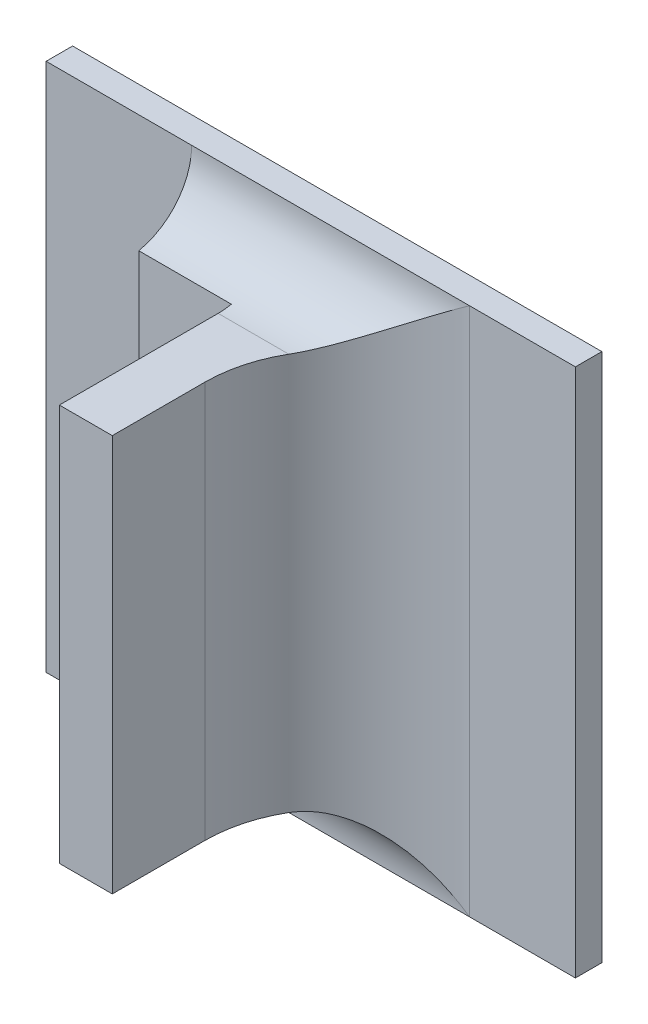
ISO-10303-21;
HEADER;
FILE_DESCRIPTION(('STEP AP214'),'2;1');
FILE_NAME('part.step','',(''),(''),'','','');
FILE_SCHEMA(('AUTOMOTIVE_DESIGN { 1 0 10303 214 1 1 1 1 }'));
ENDSEC;
DATA;
#1=APPLICATION_CONTEXT('core data for automotive mechanical design processes');
#2=APPLICATION_PROTOCOL_DEFINITION('international standard','automotive_design',2000,#1);
#3=PRODUCT_CONTEXT('',#1,'mechanical');
#4=PRODUCT('Part','Part','',(#3));
#5=PRODUCT_RELATED_PRODUCT_CATEGORY('part','',(#4));
#6=PRODUCT_DEFINITION_FORMATION('','',#4);
#7=PRODUCT_DEFINITION_CONTEXT('part definition',#1,'design');
#8=PRODUCT_DEFINITION('design','',#6,#7);
#9=PRODUCT_DEFINITION_SHAPE('','',#8);
#10=(LENGTH_UNIT() NAMED_UNIT(*) SI_UNIT(.MILLI.,.METRE.));
#11=(NAMED_UNIT(*) PLANE_ANGLE_UNIT() SI_UNIT($,.RADIAN.));
#12=(NAMED_UNIT(*) SI_UNIT($,.STERADIAN.) SOLID_ANGLE_UNIT());
#13=UNCERTAINTY_MEASURE_WITH_UNIT(LENGTH_MEASURE(1.E-05),#10,'distance_accuracy_value','');
#14=(GEOMETRIC_REPRESENTATION_CONTEXT(3) GLOBAL_UNCERTAINTY_ASSIGNED_CONTEXT((#13)) GLOBAL_UNIT_ASSIGNED_CONTEXT((#10,
#11,#12)) REPRESENTATION_CONTEXT('',''));
#15=CARTESIAN_POINT('',(0.,0.,0.));
#16=DIRECTION('',(0.,0.,1.));
#17=DIRECTION('',(1.,0.,0.));
#18=AXIS2_PLACEMENT_3D('',#15,#16,#17);
#19=CARTESIAN_POINT('',(-0.249341450663713,-0.311549667580546,0.0796271653543306));
#20=DIRECTION('',(-1.,0.,0.));
#21=DIRECTION('',(0.,-1.,0.));
#22=AXIS2_PLACEMENT_3D('',#19,#20,#21);
#23=PLANE('',#22);
#24=DIRECTION('',(0.,-1.,0.));
#25=VECTOR('',#24,1.);
#26=CARTESIAN_POINT('',(-0.249341450663713,-0.36005360458842,0.0800681102362204));
#27=LINE('',#26,#25);
#28=CARTESIAN_POINT('',(-0.249341450663713,-0.351234706950624,0.0800681102362204));
#29=VERTEX_POINT('',#28);
#30=CARTESIAN_POINT('',(-0.249341450663713,-0.313439431360073,0.0800681102362204));
#31=VERTEX_POINT('',#30);
#32=EDGE_CURVE('E116',#29,#31,#27,.F.);
#33=ORIENTED_EDGE('',*,*,#32,.T.);
#34=DIRECTION('',(0.,0.,1.));
#35=VECTOR('',#34,1.);
#36=CARTESIAN_POINT('',(-0.249341450663713,-0.313439431360073,0.0730129921259841));
#37=LINE('',#36,#35);
#38=CARTESIAN_POINT('',(-0.249341450663713,-0.313439431360073,0.0888870078740156));
#39=VERTEX_POINT('',#38);
#40=EDGE_CURVE('E294',#39,#31,#37,.F.);
#41=ORIENTED_EDGE('',*,*,#40,.F.);
#42=DIRECTION('',(0.,1.,0.));
#43=VECTOR('',#42,1.);
#44=CARTESIAN_POINT('',(-0.249341450663713,-0.311549667580546,0.0888870078740156));
#45=LINE('',#44,#43);
#46=CARTESIAN_POINT('',(-0.249341450663713,-0.351234706950624,0.0888870078740156));
#47=VERTEX_POINT('',#46);
#48=EDGE_CURVE('E306',#39,#47,#45,.F.);
#49=ORIENTED_EDGE('',*,*,#48,.T.);
#50=DIRECTION('',(0.,0.,1.));
#51=VECTOR('',#50,1.);
#52=CARTESIAN_POINT('',(-0.249341450663713,-0.351234706950624,0.0730129921259841));
#53=LINE('',#52,#51);
#54=EDGE_CURVE('E305',#47,#29,#53,.F.);
#55=ORIENTED_EDGE('',*,*,#54,.T.);
#56=EDGE_LOOP('',(#33,#41,#49,#55));
#57=FACE_BOUND('',#56,.T.);
#58=ADVANCED_FACE('F17',(#57),#23,.F.);
#59=CARTESIAN_POINT('',(-0.25463278924639,-0.311549667580546,0.0888870078740156));
#60=DIRECTION('',(0.,0.,-1.));
#61=DIRECTION('',(-1.,0.,0.));
#62=AXIS2_PLACEMENT_3D('',#59,#60,#61);
#63=PLANE('',#62);
#64=DIRECTION('',(0.,1.,0.));
#65=VECTOR('',#64,1.);
#66=CARTESIAN_POINT('',(-0.254380820742453,-0.35326446766354,0.0888870078740156));
#67=LINE('',#66,#65);
#68=CARTESIAN_POINT('',(-0.254380820742453,-0.313439431360073,0.0888870078740156));
#69=VERTEX_POINT('',#68);
#70=CARTESIAN_POINT('',(-0.254380820742453,-0.351234706950624,0.0888870078740156));
#71=VERTEX_POINT('',#70);
#72=EDGE_CURVE('E297',#69,#71,#67,.F.);
#73=ORIENTED_EDGE('',*,*,#72,.T.);
#74=DIRECTION('',(-1.,0.,0.));
#75=VECTOR('',#74,1.);
#76=CARTESIAN_POINT('',(-0.247317219784641,-0.351234706950624,0.0888870078740156));
#77=LINE('',#76,#75);
#78=EDGE_CURVE('E302',#71,#47,#77,.F.);
#79=ORIENTED_EDGE('',*,*,#78,.T.);
#80=ORIENTED_EDGE('',*,*,#48,.F.);
#81=DIRECTION('',(-1.,0.,0.));
#82=VECTOR('',#81,1.);
#83=CARTESIAN_POINT('',(-0.247317219784641,-0.313439431360073,0.0888870078740156));
#84=LINE('',#83,#82);
#85=EDGE_CURVE('E291',#69,#39,#84,.F.);
#86=ORIENTED_EDGE('',*,*,#85,.F.);
#87=EDGE_LOOP('',(#73,#79,#80,#86));
#88=FACE_BOUND('',#87,.T.);
#89=ADVANCED_FACE('F321',(#88),#63,.F.);
#90=CARTESIAN_POINT('',(-0.247317219784641,-0.351234706950624,0.0730129921259841));
#91=DIRECTION('',(0.,1.,0.));
#92=DIRECTION('',(-1.,0.,0.));
#93=AXIS2_PLACEMENT_3D('',#90,#91,#92);
#94=PLANE('',#93);
#95=DIRECTION('',(-1.,0.,0.));
#96=VECTOR('',#95,1.);
#97=CARTESIAN_POINT('',(-0.289656411293635,-0.351234706950625,0.0737688976377952));
#98=LINE('',#97,#96);
#99=CARTESIAN_POINT('',(-0.254380820742453,-0.351234706950624,0.0737688976377952));
#100=VERTEX_POINT('',#99);
#101=CARTESIAN_POINT('',(-0.247653581735013,-0.351234706950624,0.0737688976377951));
#102=VERTEX_POINT('',#101);
#103=EDGE_CURVE('E127',#100,#102,#98,.F.);
#104=ORIENTED_EDGE('',*,*,#103,.T.);
#105=CARTESIAN_POINT('',(-0.236743025466863,-0.351234706950624,0.0800681102362204));
#106=DIRECTION('',(0.,-1.,0.));
#107=DIRECTION('',(1.,0.,0.));
#108=AXIS2_PLACEMENT_3D('',#105,#106,#107);
#109=CIRCLE('',#108,0.0125984251968504);
#110=EDGE_CURVE('E20',#102,#29,#109,.F.);
#111=ORIENTED_EDGE('',*,*,#110,.T.);
#112=ORIENTED_EDGE('',*,*,#54,.F.);
#113=ORIENTED_EDGE('',*,*,#78,.F.);
#114=DIRECTION('',(0.,0.,1.));
#115=VECTOR('',#114,1.);
#116=CARTESIAN_POINT('',(-0.254380820742453,-0.351234706950624,0.0716901574803148));
#117=LINE('',#116,#115);
#118=EDGE_CURVE('E135',#71,#100,#117,.F.);
#119=ORIENTED_EDGE('',*,*,#118,.T.);
#120=EDGE_LOOP('',(#104,#111,#112,#113,#119));
#121=FACE_BOUND('',#120,.T.);
#122=ADVANCED_FACE('F133',(#121),#94,.F.);
#123=CARTESIAN_POINT('',(-0.263640663262139,-0.311409670647157,0.0725090551181101));
#124=DIRECTION('',(0.,0.,-1.));
#125=DIRECTION('',(-1.,0.,0.));
#126=AXIS2_PLACEMENT_3D('',#123,#124,#125);
#127=PLANE('',#126);
#128=DIRECTION('',(1.,0.,0.));
#129=VECTOR('',#128,1.);
#130=CARTESIAN_POINT('',(-0.235420190821194,-0.313312161420629,0.0725090551181101));
#131=LINE('',#130,#129);
#132=CARTESIAN_POINT('',(-0.254380820742453,-0.313312161420629,0.0725090551181101));
#133=VERTEX_POINT('',#132);
#134=CARTESIAN_POINT('',(-0.263199718380249,-0.313312161420629,0.0725090551181101));
#135=VERTEX_POINT('',#134);
#136=EDGE_CURVE('E142',#133,#135,#131,.F.);
#137=ORIENTED_EDGE('',*,*,#136,.T.);
#138=DIRECTION('',(0.,1.,0.));
#139=VECTOR('',#138,1.);
#140=CARTESIAN_POINT('',(-0.263199718380249,-0.304620533722278,0.0725090551181101));
#141=LINE('',#140,#139);
#142=CARTESIAN_POINT('',(-0.263199718380249,-0.351361976890069,0.0725090551181102));
#143=VERTEX_POINT('',#142);
#144=EDGE_CURVE('E146',#135,#143,#141,.F.);
#145=ORIENTED_EDGE('',*,*,#144,.T.);
#146=DIRECTION('',(-1.,0.,0.));
#147=VECTOR('',#146,1.);
#148=CARTESIAN_POINT('',(-0.289656411293635,-0.351361976890069,0.0725090551181103));
#149=LINE('',#148,#147);
#150=CARTESIAN_POINT('',(-0.254380820742453,-0.351361976890068,0.0725090551181101));
#151=VERTEX_POINT('',#150);
#152=EDGE_CURVE('E138',#143,#151,#149,.F.);
#153=ORIENTED_EDGE('',*,*,#152,.T.);
#154=DIRECTION('',(0.,1.,0.));
#155=VECTOR('',#154,1.);
#156=CARTESIAN_POINT('',(-0.254380820742453,-0.35326446766354,0.0725090551181101));
#157=LINE('',#156,#155);
#158=EDGE_CURVE('E324',#151,#133,#157,.T.);
#159=ORIENTED_EDGE('',*,*,#158,.T.);
#160=EDGE_LOOP('',(#137,#145,#153,#159));
#161=FACE_BOUND('',#160,.T.);
#162=ADVANCED_FACE('F193',(#161),#127,.F.);
#163=CARTESIAN_POINT('',(-0.236743025466863,-0.36005360458842,0.0800681102362204));
#164=DIRECTION('',(0.,-1.,0.));
#165=DIRECTION('',(1.,0.,0.));
#166=AXIS2_PLACEMENT_3D('',#163,#164,#165);
#167=CYLINDRICAL_SURFACE('',#166,0.0125984251968504);
#168=CARTESIAN_POINT('',(-0.247653581735013,-0.351234706950625,0.073768897637795));
#169=CARTESIAN_POINT('',(-0.247381097230534,-0.351235264602845,0.0732955457546591));
#170=CARTESIAN_POINT('',(-0.24707898510493,-0.351287791933284,0.0728445682080298));
#171=CARTESIAN_POINT('',(-0.246433517330929,-0.351472774611582,0.0720003898002664));
#172=CARTESIAN_POINT('',(-0.246090784855673,-0.351604122731852,0.0716064807283955));
#173=CARTESIAN_POINT('',(-0.245305547730899,-0.351954482138245,0.0708064921171964));
#174=CARTESIAN_POINT('',(-0.244856476602596,-0.35218542937407,0.0704123993317733));
#175=CARTESIAN_POINT('',(-0.243926550340997,-0.352703528005896,0.0697017381084182));
#176=CARTESIAN_POINT('',(-0.243445517070301,-0.35299101561292,0.0693856602556568));
#177=CARTESIAN_POINT('',(-0.242264779625798,-0.353727172372373,0.0687164538298326));
#178=CARTESIAN_POINT('',(-0.241555502514436,-0.354193928271792,0.0684002761150405));
#179=CARTESIAN_POINT('',(-0.240118474799579,-0.355165489292897,0.0679065689436589));
#180=CARTESIAN_POINT('',(-0.239390756039802,-0.355670231444698,0.0677288153407497));
#181=CARTESIAN_POINT('',(-0.238214793470323,-0.356494415867954,0.0675478835698786));
#182=CARTESIAN_POINT('',(-0.237768938686053,-0.356808848945619,0.0675035718032503));
#183=CARTESIAN_POINT('',(-0.237129517641484,-0.357260628255394,0.0674741343290926));
#184=CARTESIAN_POINT('',(-0.236936266991823,-0.357397277676519,0.0674696949622004));
#185=CARTESIAN_POINT('',(-0.236743025466863,-0.35753391954905,0.06746968503937));
#186=B_SPLINE_CURVE_WITH_KNOTS('',3,(#168,#169,#170,#171,#172,#173,#174,#175,#176,#177,#178,
#179,#180,#181,#182,#183,#184,#185),.UNSPECIFIED.,.F.,.F.,(4,2,2,2,2,2,2,2,4),(0.,
0.00162828046163536,0.00323420635682064,0.0051461795294393,0.00706988591555797,
0.0097736742334622,0.0124730752253369,0.0141132082090727,0.014823218803943),.UNSPECIFIED.);
#187=CARTESIAN_POINT('',(-0.236743025466863,-0.35753391954905,0.06746968503937));
#188=VERTEX_POINT('',#187);
#189=EDGE_CURVE('E113',#102,#188,#186,.T.);
#190=ORIENTED_EDGE('',*,*,#189,.T.);
#191=DIRECTION('',(0.,1.,0.));
#192=VECTOR('',#191,1.);
#193=CARTESIAN_POINT('',(-0.236743025466863,-0.304620533722278,0.06746968503937));
#194=LINE('',#193,#192);
#195=CARTESIAN_POINT('',(-0.236743025466863,-0.307140218761648,0.06746968503937));
#196=VERTEX_POINT('',#195);
#197=EDGE_CURVE('E279',#196,#188,#194,.F.);
#198=ORIENTED_EDGE('',*,*,#197,.F.);
#199=CARTESIAN_POINT('',(-0.236743025466863,-0.307140218761648,0.06746968503937));
#200=CARTESIAN_POINT('',(-0.236743025561178,-0.307140317600168,0.0674696850393615));
#201=CARTESIAN_POINT('',(-0.236743035711689,-0.307140416428939,0.0674696850424135));
#202=CARTESIAN_POINT('',(-0.236743071554647,-0.307140611354748,0.0674696850532617));
#203=CARTESIAN_POINT('',(-0.236743097312692,-0.307140707438454,0.0674696850610781));
#204=CARTESIAN_POINT('',(-0.236743161234714,-0.307140897584729,0.0674696850805151));
#205=CARTESIAN_POINT('',(-0.236743199652295,-0.30714099156009,0.0674696850922136));
#206=CARTESIAN_POINT('',(-0.236743285901283,-0.307141174837888,0.0674696851185221));
#207=CARTESIAN_POINT('',(-0.236743333722638,-0.307141264145186,0.067469685133129));
#208=CARTESIAN_POINT('',(-0.236743496133634,-0.307141540902339,0.0674696851828237));
#209=CARTESIAN_POINT('',(-0.236743623394443,-0.307141720962886,0.0674696852218837));
#210=CARTESIAN_POINT('',(-0.236743898227166,-0.307142061590547,0.0674696853066755));
#211=CARTESIAN_POINT('',(-0.236744045634316,-0.307142222297702,0.0674696853523532));
#212=CARTESIAN_POINT('',(-0.236744572874454,-0.30714275975848,0.0674696855167746));
#213=CARTESIAN_POINT('',(-0.236744979066102,-0.307143110950677,0.0674696856452023));
#214=CARTESIAN_POINT('',(-0.236745819022063,-0.307143742641604,0.0674696859163221));
#215=CARTESIAN_POINT('',(-0.236746251343344,-0.307144025168177,0.0674696860583658));
#216=CARTESIAN_POINT('',(-0.236747929520131,-0.307145088805981,0.0674696866214032));
#217=CARTESIAN_POINT('',(-0.236749202112725,-0.307145826268706,0.0674696870727233));
#218=CARTESIAN_POINT('',(-0.23675167647155,-0.307147133962223,0.0674696882497374));
#219=CARTESIAN_POINT('',(-0.236752873245632,-0.307147713460052,0.0674696889448008));
#220=CARTESIAN_POINT('',(-0.236760733081675,-0.307151849249197,0.0674696947394657));
#221=CARTESIAN_POINT('',(-0.236766683642971,-0.307156609323054,0.067469705198469));
#222=CARTESIAN_POINT('',(-0.23678876576196,-0.307173483152928,0.0674697594501571));
#223=CARTESIAN_POINT('',(-0.236805410509174,-0.307184696077486,0.0674698297573796));
#224=CARTESIAN_POINT('',(-0.236866178253526,-0.307226386954018,0.0674702062030112));
#225=CARTESIAN_POINT('',(-0.236909783791606,-0.3072577750903,0.0674707100991553));
#226=CARTESIAN_POINT('',(-0.237076151381455,-0.307376764604736,0.0674735003948733));
#227=CARTESIAN_POINT('',(-0.237199443569314,-0.307463363679941,0.0674773623702134));
#228=CARTESIAN_POINT('',(-0.238239478224743,-0.308194415116375,0.0675251688134004));
#229=CARTESIAN_POINT('',(-0.239154033889424,-0.308840824556345,0.0676670910917156));
#230=CARTESIAN_POINT('',(-0.240817374486494,-0.309985925569802,0.0681207439021359));
#231=CARTESIAN_POINT('',(-0.241569541041457,-0.310491829145844,0.0684021380812103));
#232=CARTESIAN_POINT('',(-0.242799453417008,-0.311283401329248,0.0690071450776349));
#233=CARTESIAN_POINT('',(-0.243286868949137,-0.311587175065945,0.0692872417521838));
#234=CARTESIAN_POINT('',(-0.244253937729218,-0.312158547189347,0.0699361732585048));
#235=CARTESIAN_POINT('',(-0.244732778748888,-0.312424585539931,0.0703076754457103));
#236=CARTESIAN_POINT('',(-0.245530787237025,-0.312823166861075,0.0710290250498739));
#237=CARTESIAN_POINT('',(-0.245859114349156,-0.31297243520059,0.0713594163896828));
#238=CARTESIAN_POINT('',(-0.246483189565351,-0.313215602302386,0.0720638443645075));
#239=CARTESIAN_POINT('',(-0.246779185390082,-0.313309950219131,0.0724374961036003));
#240=CARTESIAN_POINT('',(-0.247272983005237,-0.313415914374917,0.0731410386617689));
#241=CARTESIAN_POINT('',(-0.247478339545381,-0.31344076414939,0.0734635869359734));
#242=CARTESIAN_POINT('',(-0.247858964706651,-0.313437989894047,0.0741265585439532));
#243=CARTESIAN_POINT('',(-0.248034211993844,-0.31341032882348,0.0744669943307326));
#244=CARTESIAN_POINT('',(-0.24835085657272,-0.313294679389271,0.0751565544091364));
#245=CARTESIAN_POINT('',(-0.248492015390861,-0.313206281764493,0.0755057220621308));
#246=CARTESIAN_POINT('',(-0.248736821847096,-0.312965001062621,0.0761947785868874));
#247=CARTESIAN_POINT('',(-0.24884049711276,-0.312812165660658,0.0765346741211982));
#248=CARTESIAN_POINT('',(-0.249002200825383,-0.312466071945116,0.0771489075153616));
#249=CARTESIAN_POINT('',(-0.249064219655145,-0.312279886373216,0.0774262133810267));
#250=CARTESIAN_POINT('',(-0.249165027223599,-0.311863410254162,0.0779502251276347));
#251=CARTESIAN_POINT('',(-0.24920381604834,-0.311633119870385,0.0781969311219235));
#252=CARTESIAN_POINT('',(-0.249263085619279,-0.311139310998908,0.0786471201676947));
#253=CARTESIAN_POINT('',(-0.249283881362749,-0.310876460373297,0.0788512972752939));
#254=CARTESIAN_POINT('',(-0.249313931197335,-0.310321433419959,0.0792159384509799));
#255=CARTESIAN_POINT('',(-0.249323183714322,-0.310029253098465,0.0793763965548561));
#256=CARTESIAN_POINT('',(-0.249335481758209,-0.309410568564247,0.0796549300095399));
#257=CARTESIAN_POINT('',(-0.24933825443422,-0.309083144094315,0.0797709755115422));
#258=CARTESIAN_POINT('',(-0.249341187975604,-0.308413669505017,0.0799477574285475));
#259=CARTESIAN_POINT('',(-0.24934134854907,-0.308071617755308,0.0800084876612566));
#260=CARTESIAN_POINT('',(-0.249341494869743,-0.307374847298272,0.0800736589499428));
#261=CARTESIAN_POINT('',(-0.249341476839972,-0.307020013767971,0.0800768798691539));
#262=CARTESIAN_POINT('',(-0.249341399430035,-0.306314811859268,0.0800238026376847));
#263=CARTESIAN_POINT('',(-0.249341340047097,-0.305964443781737,0.0799675004977201));
#264=CARTESIAN_POINT('',(-0.249338816545308,-0.305277507288453,0.0797968199531621));
#265=CARTESIAN_POINT('',(-0.249336348285399,-0.304940963676405,0.0796823417014521));
#266=CARTESIAN_POINT('',(-0.249324442279099,-0.30429193671443,0.079398533160437));
#267=CARTESIAN_POINT('',(-0.249315004281672,-0.30397945423159,0.0792292008955119));
#268=CARTESIAN_POINT('',(-0.249283133898883,-0.303389548026495,0.0788419881994159));
#269=CARTESIAN_POINT('',(-0.249260780314472,-0.303111924019511,0.0786244070629531));
#270=CARTESIAN_POINT('',(-0.249196492322061,-0.302598008180998,0.0781473882147605));
#271=CARTESIAN_POINT('',(-0.249154565385348,-0.30236170062595,0.0778879664985857));
#272=CARTESIAN_POINT('',(-0.249046972821505,-0.301944772977547,0.0773466142760766));
#273=CARTESIAN_POINT('',(-0.248982185360282,-0.301762499248574,0.0770657832005055));
#274=CARTESIAN_POINT('',(-0.248824923932462,-0.301447086827108,0.0764850450664438));
#275=CARTESIAN_POINT('',(-0.24873245846948,-0.301313933071312,0.076185143889188));
#276=CARTESIAN_POINT('',(-0.248521538865257,-0.301100802250232,0.0755865038391837));
#277=CARTESIAN_POINT('',(-0.24840389597002,-0.301019424424719,0.075287973128724));
#278=CARTESIAN_POINT('',(-0.24814218097561,-0.300901879920434,0.0746936193238616));
#279=CARTESIAN_POINT('',(-0.247998095002797,-0.300865737052864,0.0743977977367696));
#280=CARTESIAN_POINT('',(-0.247675985006159,-0.300833457265666,0.0737980252798641));
#281=CARTESIAN_POINT('',(-0.247496364232692,-0.300840072083108,0.0734947949351433));
#282=CARTESIAN_POINT('',(-0.247114533450582,-0.300893220663338,0.0729074487273723));
#283=CARTESIAN_POINT('',(-0.246912344605639,-0.300939717295166,0.0726233153498299));
#284=CARTESIAN_POINT('',(-0.246377635909317,-0.301099160254376,0.0719334846819082));
#285=CARTESIAN_POINT('',(-0.246032559317314,-0.301234206619572,0.0715425793781452));
#286=CARTESIAN_POINT('',(-0.245307881758886,-0.301562359739769,0.0708143812686402));
#287=CARTESIAN_POINT('',(-0.244927942881203,-0.301756088608605,0.0704777252629507));
#288=CARTESIAN_POINT('',(-0.243973277001398,-0.302279339643324,0.0697260645086063));
#289=CARTESIAN_POINT('',(-0.243386496187727,-0.302631080843893,0.0693419139325727));
#290=CARTESIAN_POINT('',(-0.242211614141247,-0.303370485460523,0.0686995101782902));
#291=CARTESIAN_POINT('',(-0.241624601406146,-0.303756022313255,0.0684366507296656));
#292=CARTESIAN_POINT('',(-0.240475711434441,-0.304528568289244,0.0680209366897775));
#293=CARTESIAN_POINT('',(-0.239914790963233,-0.304913742395931,0.0678618837368313));
#294=CARTESIAN_POINT('',(-0.238678396893406,-0.305774456157341,0.0676002423539603));
#295=CARTESIAN_POINT('',(-0.238001506201216,-0.306253204314875,0.0675142406050073));
#296=CARTESIAN_POINT('',(-0.237199965410212,-0.306816723517622,0.0674773844657497));
#297=CARTESIAN_POINT('',(-0.23707717255178,-0.306902958808099,0.0674735321464733));
#298=CARTESIAN_POINT('',(-0.23691095115866,-0.307021838644933,0.0674707243957125));
#299=CARTESIAN_POINT('',(-0.23686699007756,-0.307053485081974,0.0674702128513251));
#300=CARTESIAN_POINT('',(-0.236805744457095,-0.307095501849072,0.0674698312735403));
#301=CARTESIAN_POINT('',(-0.236788982935183,-0.307106792621677,0.0674697601164235));
#302=CARTESIAN_POINT('',(-0.236766762163053,-0.307123774563246,0.0674697053274289));
#303=CARTESIAN_POINT('',(-0.236760785208598,-0.307128556132832,0.067469694787842));
#304=CARTESIAN_POINT('',(-0.236752891188343,-0.307132705901441,0.0674696889590613));
#305=CARTESIAN_POINT('',(-0.236751691236482,-0.307133286333551,0.0674696882612312));
#306=CARTESIAN_POINT('',(-0.236749210403117,-0.307134597075486,0.0674696870796236));
#307=CARTESIAN_POINT('',(-0.236747934575438,-0.307135336773202,0.0674696866266876));
#308=CARTESIAN_POINT('',(-0.236746252739726,-0.307136403621154,0.0674696860616838));
#309=CARTESIAN_POINT('',(-0.236745819780416,-0.307136686826689,0.0674696859192268));
#310=CARTESIAN_POINT('',(-0.236744978706978,-0.307137320138761,0.0674696856472792));
#311=CARTESIAN_POINT('',(-0.236744572045491,-0.307137672284289,0.0674696855184389));
#312=CARTESIAN_POINT('',(-0.23674404439611,-0.30713821114919,0.0674696853534853));
#313=CARTESIAN_POINT('',(-0.23674389692601,-0.307138372237131,0.067469685307667));
#314=CARTESIAN_POINT('',(-0.236743622046559,-0.307138713663398,0.0674696852226042));
#315=CARTESIAN_POINT('',(-0.236743494802887,-0.30713889414225,0.0674696851834138));
#316=CARTESIAN_POINT('',(-0.236743332506109,-0.307139171508259,0.0674696851335454));
#317=CARTESIAN_POINT('',(-0.236743284736199,-0.307139261001292,0.067469685118887));
#318=CARTESIAN_POINT('',(-0.236743198620652,-0.30713944464998,0.0674696850924812));
#319=CARTESIAN_POINT('',(-0.236743160285127,-0.307139538810509,0.067469685080737));
#320=CARTESIAN_POINT('',(-0.236743096564087,-0.307139729312035,0.067469685061218));
#321=CARTESIAN_POINT('',(-0.236743070923738,-0.307139825565832,0.0674696850533652));
#322=CARTESIAN_POINT('',(-0.236743035360896,-0.307140020812425,0.0674696850424555));
#323=CARTESIAN_POINT('',(-0.236743025372423,-0.307140119791924,0.0674696850393785));
#324=CARTESIAN_POINT('',(-0.236743025466863,-0.307140218761648,0.06746968503937));
#325=B_SPLINE_CURVE_WITH_KNOTS('',3,(#199,#200,#201,#202,#203,#204,#205,#206,#207,#208,#209,
#210,#211,#212,#213,#214,#215,#216,#217,#218,#219,#220,#221,#222,#223,#224,#225,#226,#227,#228,
#229,#230,#231,#232,#233,#234,#235,#236,#237,#238,#239,#240,#241,#242,#243,#244,#245,#246,#247,
#248,#249,#250,#251,#252,#253,#254,#255,#256,#257,#258,#259,#260,#261,#262,#263,#264,#265,#266,
#267,#268,#269,#270,#271,#272,#273,#274,#275,#276,#277,#278,#279,#280,#281,#282,#283,#284,#285,
#286,#287,#288,#289,#290,#291,#292,#293,#294,#295,#296,#297,#298,#299,#300,#301,#302,#303,#304,
#305,#306,#307,#308,#309,#310,#311,#312,#313,#314,#315,#316,#317,#318,#319,#320,#321,#322,#323,
#324),.UNSPECIFIED.,.T.,.F.,(4,2,2,2,2,2,2,2,2,2,2,2,2,2,2,2,2,2,2,2,2,2,2,2,2,2,2,2,2,2,2,2,2,
2,2,2,2,2,2,2,2,2,2,2,2,2,2,2,2,2,2,2,2,2,2,2,2,2,2,2,2,2,4),(0.,2.96262718474742E-07,
5.9377935610145E-07,8.97660571576497E-07,1.2012186998182E-06,1.8598393992571E-06,
2.5133644004238E-06,4.11695718379365E-06,5.66498675237814E-06,1.007427229962E-05,
1.4058662976886E-05,3.67471450073431E-05,9.70745534320937E-05,0.000258117828158617,
0.000710418104869198,0.00407475533961825,0.00690809627288587,0.00881968522125093,
0.0107955574621808,0.0122580167053817,0.0137083411294308,0.0148534027078703,0.0159992723041916,
0.017152939826701,0.0183057552869512,0.0193199166517908,0.0203340742599354,0.0213300957694083,
0.0223262530896367,0.0233636546164693,0.024401172073937,0.0254606762934847,0.0265202515263763,
0.0275816514712124,0.0286430896476357,0.0296981191234644,0.0307527462159096,0.0317706214790939,
0.032788184337071,0.0337768943877515,0.0347661246662931,0.0358196249691737,0.0368721455004046,
0.0384790134244904,0.0401035507750209,0.0424440092075652,0.0446862628276771,0.0467780451238264,
0.0492693497424134,0.049719781732113,0.0498821419378972,0.0499428919104112,0.0499656810460578,
0.0499696752051923,0.0499740961721065,0.049975646909701,0.049977253393487,0.0499779078855007,
0.049978567489383,0.0499788714648539,0.0499791757647538,0.0499794736800123,0.0499797703360084),.UNSPECIFIED.);
#326=CARTESIAN_POINT('',(-0.247653581735013,-0.313439431360073,0.0737688976377952));
#327=VERTEX_POINT('',#326);
#328=EDGE_CURVE('E197',#196,#327,#325,.T.);
#329=ORIENTED_EDGE('',*,*,#328,.T.);
#330=CARTESIAN_POINT('',(-0.236743025466863,-0.313439431360073,0.0800681102362204));
#331=DIRECTION('',(0.,1.,0.));
#332=DIRECTION('',(-1.,0.,0.));
#333=AXIS2_PLACEMENT_3D('',#330,#331,#332);
#334=CIRCLE('',#333,0.0125984251968504);
#335=EDGE_CURVE('E121',#31,#327,#334,.F.);
#336=ORIENTED_EDGE('',*,*,#335,.F.);
#337=ORIENTED_EDGE('',*,*,#32,.F.);
#338=ORIENTED_EDGE('',*,*,#110,.F.);
#339=EDGE_LOOP('',(#190,#198,#329,#336,#337,#338));
#340=FACE_BOUND('',#339,.T.);
#341=ADVANCED_FACE('F111',(#340),#167,.F.);
#342=CARTESIAN_POINT('',(-0.247317219784641,-0.313439431360073,0.0730129921259841));
#343=DIRECTION('',(0.,1.,0.));
#344=DIRECTION('',(-1.,0.,0.));
#345=AXIS2_PLACEMENT_3D('',#342,#343,#344);
#346=PLANE('',#345);
#347=ORIENTED_EDGE('',*,*,#85,.T.);
#348=ORIENTED_EDGE('',*,*,#40,.T.);
#349=ORIENTED_EDGE('',*,*,#335,.T.);
#350=DIRECTION('',(1.,0.,0.));
#351=VECTOR('',#350,1.);
#352=CARTESIAN_POINT('',(-0.235420190821194,-0.313439431360073,0.0737688976377952));
#353=LINE('',#352,#351);
#354=CARTESIAN_POINT('',(-0.254380820742453,-0.313439431360073,0.0737688976377952));
#355=VERTEX_POINT('',#354);
#356=EDGE_CURVE('E266',#327,#355,#353,.F.);
#357=ORIENTED_EDGE('',*,*,#356,.T.);
#358=DIRECTION('',(0.,0.,1.));
#359=VECTOR('',#358,1.);
#360=CARTESIAN_POINT('',(-0.254380820742453,-0.313439431360073,0.0716901574803148));
#361=LINE('',#360,#359);
#362=EDGE_CURVE('E149',#355,#69,#361,.T.);
#363=ORIENTED_EDGE('',*,*,#362,.T.);
#364=EDGE_LOOP('',(#347,#348,#349,#357,#363));
#365=FACE_BOUND('',#364,.T.);
#366=ADVANCED_FACE('F183',(#365),#346,.T.);
#367=CARTESIAN_POINT('',(-0.254380820742453,-0.35326446766354,0.0716901574803148));
#368=DIRECTION('',(1.,0.,0.));
#369=DIRECTION('',(0.,1.,0.));
#370=AXIS2_PLACEMENT_3D('',#367,#368,#369);
#371=PLANE('',#370);
#372=CARTESIAN_POINT('',(-0.254380820742453,-0.313312161420629,0.0725090551181101));
#373=CARTESIAN_POINT('',(-0.254380820742453,-0.313439431360073,0.0731325479405746));
#374=CARTESIAN_POINT('',(-0.254380820742453,-0.313439431360073,0.0737688976377952));
#375=B_SPLINE_CURVE_WITH_KNOTS('',2,(#372,#373,#374),.UNSPECIFIED.,.F.,.F.,(3,3),(0.,1.),.UNSPECIFIED.);
#376=EDGE_CURVE('E153',#355,#133,#375,.F.);
#377=ORIENTED_EDGE('',*,*,#376,.T.);
#378=ORIENTED_EDGE('',*,*,#158,.F.);
#379=CARTESIAN_POINT('',(-0.254380820742453,-0.351234706950624,0.0737688976377952));
#380=CARTESIAN_POINT('',(-0.254380820742453,-0.351234706950624,0.0731325479405795));
#381=CARTESIAN_POINT('',(-0.254380820742453,-0.351361976890068,0.0725090551181101));
#382=B_SPLINE_CURVE_WITH_KNOTS('',2,(#379,#380,#381),.UNSPECIFIED.,.F.,.F.,(3,3),(0.,1.),.UNSPECIFIED.);
#383=EDGE_CURVE('E136',#151,#100,#382,.F.);
#384=ORIENTED_EDGE('',*,*,#383,.T.);
#385=ORIENTED_EDGE('',*,*,#118,.F.);
#386=ORIENTED_EDGE('',*,*,#72,.F.);
#387=ORIENTED_EDGE('',*,*,#362,.F.);
#388=EDGE_LOOP('',(#377,#378,#384,#385,#386,#387));
#389=FACE_BOUND('',#388,.T.);
#390=ADVANCED_FACE('F172',(#389),#371,.F.);
#391=CARTESIAN_POINT('',(-0.263199718380249,-0.304620533722278,0.067217716535433));
#392=DIRECTION('',(1.,0.,0.));
#393=DIRECTION('',(0.,1.,0.));
#394=AXIS2_PLACEMENT_3D('',#391,#392,#393);
#395=PLANE('',#394);
#396=CARTESIAN_POINT('',(-0.263199718380249,-0.307140218761648,0.0737688976377952));
#397=DIRECTION('',(1.,0.,0.));
#398=DIRECTION('',(0.,1.,0.));
#399=AXIS2_PLACEMENT_3D('',#396,#397,#398);
#400=CIRCLE('',#399,0.0062992125984252);
#401=CARTESIAN_POINT('',(-0.263199718380249,-0.307140218761648,0.06746968503937));
#402=VERTEX_POINT('',#401);
#403=EDGE_CURVE('E272',#135,#402,#400,.T.);
#404=ORIENTED_EDGE('',*,*,#403,.T.);
#405=DIRECTION('',(0.,1.,0.));
#406=VECTOR('',#405,1.);
#407=CARTESIAN_POINT('',(-0.263199718380249,-0.304620533722278,0.06746968503937));
#408=LINE('',#407,#406);
#409=CARTESIAN_POINT('',(-0.263199718380249,-0.35753391954905,0.06746968503937));
#410=VERTEX_POINT('',#409);
#411=EDGE_CURVE('E150',#410,#402,#408,.T.);
#412=ORIENTED_EDGE('',*,*,#411,.F.);
#413=CARTESIAN_POINT('',(-0.263199718380249,-0.35753391954905,0.0737688976377952));
#414=DIRECTION('',(-1.,0.,0.));
#415=DIRECTION('',(0.,-1.,0.));
#416=AXIS2_PLACEMENT_3D('',#413,#414,#415);
#417=CIRCLE('',#416,0.0062992125984252);
#418=EDGE_CURVE('E131',#410,#143,#417,.F.);
#419=ORIENTED_EDGE('',*,*,#418,.T.);
#420=ORIENTED_EDGE('',*,*,#144,.F.);
#421=EDGE_LOOP('',(#404,#412,#419,#420));
#422=FACE_BOUND('',#421,.T.);
#423=ADVANCED_FACE('F182',(#422),#395,.F.);
#424=CARTESIAN_POINT('',(-0.289656411293635,-0.35753391954905,0.0737688976377952));
#425=DIRECTION('',(-1.,0.,0.));
#426=DIRECTION('',(0.,-1.,0.));
#427=AXIS2_PLACEMENT_3D('',#424,#425,#426);
#428=CYLINDRICAL_SURFACE('',#427,0.0062992125984252);
#429=DIRECTION('',(-1.,0.,0.));
#430=VECTOR('',#429,1.);
#431=CARTESIAN_POINT('',(-0.224144600270013,-0.35753391954905,0.06746968503937));
#432=LINE('',#431,#430);
#433=EDGE_CURVE('E130',#410,#188,#432,.F.);
#434=ORIENTED_EDGE('',*,*,#433,.T.);
#435=ORIENTED_EDGE('',*,*,#189,.F.);
#436=ORIENTED_EDGE('',*,*,#103,.F.);
#437=ORIENTED_EDGE('',*,*,#383,.F.);
#438=ORIENTED_EDGE('',*,*,#152,.F.);
#439=ORIENTED_EDGE('',*,*,#418,.F.);
#440=EDGE_LOOP('',(#434,#435,#436,#437,#438,#439));
#441=FACE_BOUND('',#440,.T.);
#442=ADVANCED_FACE('F125',(#441),#428,.F.);
#443=CARTESIAN_POINT('',(-0.226160348301509,-0.304620533722278,0.06746968503937));
#444=DIRECTION('',(0.,0.,1.));
#445=DIRECTION('',(1.,0.,0.));
#446=AXIS2_PLACEMENT_3D('',#443,#444,#445);
#447=PLANE('',#446);
#448=DIRECTION('',(0.,-1.,0.));
#449=VECTOR('',#448,1.);
#450=CARTESIAN_POINT('',(-0.226664285309383,-0.304620533722278,0.06746968503937));
#451=LINE('',#450,#449);
#452=CARTESIAN_POINT('',(-0.226664285309383,-0.35753391954905,0.06746968503937));
#453=VERTEX_POINT('',#452);
#454=CARTESIAN_POINT('',(-0.226664285309383,-0.307140218761648,0.06746968503937));
#455=VERTEX_POINT('',#454);
#456=EDGE_CURVE('E262',#453,#455,#451,.F.);
#457=ORIENTED_EDGE('',*,*,#456,.T.);
#458=DIRECTION('',(1.,0.,0.));
#459=VECTOR('',#458,1.);
#460=CARTESIAN_POINT('',(-0.279577671136154,-0.307140218761648,0.06746968503937));
#461=LINE('',#460,#459);
#462=EDGE_CURVE('E166',#455,#196,#461,.F.);
#463=ORIENTED_EDGE('',*,*,#462,.T.);
#464=ORIENTED_EDGE('',*,*,#197,.T.);
#465=DIRECTION('',(-1.,0.,0.));
#466=VECTOR('',#465,1.);
#467=CARTESIAN_POINT('',(-0.224144600270013,-0.35753391954905,0.06746968503937));
#468=LINE('',#467,#466);
#469=EDGE_CURVE('E155',#188,#453,#468,.F.);
#470=ORIENTED_EDGE('',*,*,#469,.T.);
#471=EDGE_LOOP('',(#457,#463,#464,#470));
#472=FACE_BOUND('',#471,.T.);
#473=ADVANCED_FACE('F211',(#472),#447,.T.);
#474=CARTESIAN_POINT('',(-0.235420190821194,-0.307140218761648,0.0737688976377952));
#475=DIRECTION('',(1.,0.,0.));
#476=DIRECTION('',(0.,1.,0.));
#477=AXIS2_PLACEMENT_3D('',#474,#475,#476);
#478=CYLINDRICAL_SURFACE('',#477,0.0062992125984252);
#479=ORIENTED_EDGE('',*,*,#356,.F.);
#480=ORIENTED_EDGE('',*,*,#328,.F.);
#481=DIRECTION('',(1.,0.,0.));
#482=VECTOR('',#481,1.);
#483=CARTESIAN_POINT('',(-0.279577671136154,-0.307140218761648,0.06746968503937));
#484=LINE('',#483,#482);
#485=EDGE_CURVE('E164',#196,#402,#484,.F.);
#486=ORIENTED_EDGE('',*,*,#485,.T.);
#487=ORIENTED_EDGE('',*,*,#403,.F.);
#488=ORIENTED_EDGE('',*,*,#136,.F.);
#489=ORIENTED_EDGE('',*,*,#376,.F.);
#490=EDGE_LOOP('',(#479,#480,#486,#487,#488,#489));
#491=FACE_BOUND('',#490,.T.);
#492=ADVANCED_FACE('F213',(#491),#478,.F.);
#493=CARTESIAN_POINT('',(-0.262506804994422,-0.304620533722278,0.06746968503937));
#494=DIRECTION('',(0.,0.,1.));
#495=DIRECTION('',(1.,0.,0.));
#496=AXIS2_PLACEMENT_3D('',#493,#494,#495);
#497=PLANE('',#496);
#498=DIRECTION('',(1.,0.,0.));
#499=VECTOR('',#498,1.);
#500=CARTESIAN_POINT('',(-0.279577671136154,-0.307140218761648,0.06746968503937));
#501=LINE('',#500,#499);
#502=CARTESIAN_POINT('',(-0.277057986096784,-0.307140218761648,0.06746968503937));
#503=VERTEX_POINT('',#502);
#504=EDGE_CURVE('E160',#402,#503,#501,.F.);
#505=ORIENTED_EDGE('',*,*,#504,.T.);
#506=DIRECTION('',(0.,1.,0.));
#507=VECTOR('',#506,1.);
#508=CARTESIAN_POINT('',(-0.277057986096784,-0.36005360458842,0.06746968503937));
#509=LINE('',#508,#507);
#510=CARTESIAN_POINT('',(-0.277057986096784,-0.35753391954905,0.06746968503937));
#511=VERTEX_POINT('',#510);
#512=EDGE_CURVE('E152',#503,#511,#509,.F.);
#513=ORIENTED_EDGE('',*,*,#512,.T.);
#514=DIRECTION('',(-1.,0.,0.));
#515=VECTOR('',#514,1.);
#516=CARTESIAN_POINT('',(-0.224144600270013,-0.35753391954905,0.06746968503937));
#517=LINE('',#516,#515);
#518=EDGE_CURVE('E156',#511,#410,#517,.F.);
#519=ORIENTED_EDGE('',*,*,#518,.T.);
#520=ORIENTED_EDGE('',*,*,#411,.T.);
#521=EDGE_LOOP('',(#505,#513,#519,#520));
#522=FACE_BOUND('',#521,.T.);
#523=ADVANCED_FACE('F218',(#522),#497,.T.);
#524=CARTESIAN_POINT('',(-0.277057986096784,-0.36005360458842,0.0648240157480314));
#525=DIRECTION('',(1.,0.,0.));
#526=DIRECTION('',(0.,1.,0.));
#527=AXIS2_PLACEMENT_3D('',#524,#525,#526);
#528=PLANE('',#527);
#529=DIRECTION('',(0.,0.,1.));
#530=VECTOR('',#529,1.);
#531=CARTESIAN_POINT('',(-0.277057986096784,-0.35753391954905,0.0648240157480314));
#532=LINE('',#531,#530);
#533=CARTESIAN_POINT('',(-0.277057986096784,-0.35753391954905,0.0649499999999999));
#534=VERTEX_POINT('',#533);
#535=EDGE_CURVE('E159',#534,#511,#532,.T.);
#536=ORIENTED_EDGE('',*,*,#535,.T.);
#537=ORIENTED_EDGE('',*,*,#512,.F.);
#538=DIRECTION('',(0.,0.,1.));
#539=VECTOR('',#538,1.);
#540=CARTESIAN_POINT('',(-0.277057986096784,-0.307140218761648,0.0648240157480314));
#541=LINE('',#540,#539);
#542=CARTESIAN_POINT('',(-0.277057986096784,-0.307140218761648,0.0649499999999999));
#543=VERTEX_POINT('',#542);
#544=EDGE_CURVE('E163',#503,#543,#541,.F.);
#545=ORIENTED_EDGE('',*,*,#544,.T.);
#546=DIRECTION('',(0.,1.,0.));
#547=VECTOR('',#546,1.);
#548=CARTESIAN_POINT('',(-0.277057986096784,-0.304620533722278,0.0649499999999999));
#549=LINE('',#548,#547);
#550=EDGE_CURVE('E255',#543,#534,#549,.F.);
#551=ORIENTED_EDGE('',*,*,#550,.T.);
#552=EDGE_LOOP('',(#536,#537,#545,#551));
#553=FACE_BOUND('',#552,.T.);
#554=ADVANCED_FACE('F222',(#553),#528,.F.);
#555=CARTESIAN_POINT('',(-0.224144600270013,-0.35753391954905,0.0648240157480314));
#556=DIRECTION('',(0.,1.,0.));
#557=DIRECTION('',(-1.,0.,0.));
#558=AXIS2_PLACEMENT_3D('',#555,#556,#557);
#559=PLANE('',#558);
#560=DIRECTION('',(0.,0.,1.));
#561=VECTOR('',#560,1.);
#562=CARTESIAN_POINT('',(-0.226664285309383,-0.35753391954905,0.0648240157480314));
#563=LINE('',#562,#561);
#564=CARTESIAN_POINT('',(-0.226664285309383,-0.35753391954905,0.0649499999999999));
#565=VERTEX_POINT('',#564);
#566=EDGE_CURVE('E252',#565,#453,#563,.T.);
#567=ORIENTED_EDGE('',*,*,#566,.T.);
#568=ORIENTED_EDGE('',*,*,#469,.F.);
#569=ORIENTED_EDGE('',*,*,#433,.F.);
#570=ORIENTED_EDGE('',*,*,#518,.F.);
#571=ORIENTED_EDGE('',*,*,#535,.F.);
#572=DIRECTION('',(1.,0.,0.));
#573=VECTOR('',#572,1.);
#574=CARTESIAN_POINT('',(-0.224144600270013,-0.35753391954905,0.0649499999999999));
#575=LINE('',#574,#573);
#576=EDGE_CURVE('E248',#534,#565,#575,.T.);
#577=ORIENTED_EDGE('',*,*,#576,.T.);
#578=EDGE_LOOP('',(#567,#568,#569,#570,#571,#577));
#579=FACE_BOUND('',#578,.T.);
#580=ADVANCED_FACE('F226',(#579),#559,.F.);
#581=CARTESIAN_POINT('',(-0.226664285309383,-0.304620533722278,0.0648240157480314));
#582=DIRECTION('',(-1.,0.,0.));
#583=DIRECTION('',(0.,-1.,0.));
#584=AXIS2_PLACEMENT_3D('',#581,#582,#583);
#585=PLANE('',#584);
#586=DIRECTION('',(0.,0.,1.));
#587=VECTOR('',#586,1.);
#588=CARTESIAN_POINT('',(-0.226664285309383,-0.307140218761648,0.0648240157480314));
#589=LINE('',#588,#587);
#590=CARTESIAN_POINT('',(-0.226664285309383,-0.307140218761648,0.0649499999999999));
#591=VERTEX_POINT('',#590);
#592=EDGE_CURVE('E34',#591,#455,#589,.T.);
#593=ORIENTED_EDGE('',*,*,#592,.T.);
#594=ORIENTED_EDGE('',*,*,#456,.F.);
#595=ORIENTED_EDGE('',*,*,#566,.F.);
#596=DIRECTION('',(0.,1.,0.));
#597=VECTOR('',#596,1.);
#598=CARTESIAN_POINT('',(-0.226664285309383,-0.304620533722278,0.0649499999999999));
#599=LINE('',#598,#597);
#600=EDGE_CURVE('E26',#565,#591,#599,.T.);
#601=ORIENTED_EDGE('',*,*,#600,.T.);
#602=EDGE_LOOP('',(#593,#594,#595,#601));
#603=FACE_BOUND('',#602,.T.);
#604=ADVANCED_FACE('F230',(#603),#585,.F.);
#605=CARTESIAN_POINT('',(-0.279577671136154,-0.307140218761648,0.0648240157480314));
#606=DIRECTION('',(0.,-1.,0.));
#607=DIRECTION('',(1.,0.,0.));
#608=AXIS2_PLACEMENT_3D('',#605,#606,#607);
#609=PLANE('',#608);
#610=ORIENTED_EDGE('',*,*,#544,.F.);
#611=ORIENTED_EDGE('',*,*,#504,.F.);
#612=ORIENTED_EDGE('',*,*,#485,.F.);
#613=ORIENTED_EDGE('',*,*,#462,.F.);
#614=ORIENTED_EDGE('',*,*,#592,.F.);
#615=DIRECTION('',(1.,0.,0.));
#616=VECTOR('',#615,1.);
#617=CARTESIAN_POINT('',(-0.224144600270013,-0.307140218761648,0.0649499999999999));
#618=LINE('',#617,#616);
#619=EDGE_CURVE('E11',#591,#543,#618,.F.);
#620=ORIENTED_EDGE('',*,*,#619,.T.);
#621=EDGE_LOOP('',(#610,#611,#612,#613,#614,#620));
#622=FACE_BOUND('',#621,.T.);
#623=ADVANCED_FACE('F234',(#622),#609,.F.);
#624=CARTESIAN_POINT('',(-0.224144600270013,-0.304620533722278,0.0649499999999999));
#625=DIRECTION('',(0.,0.,1.));
#626=DIRECTION('',(1.,0.,0.));
#627=AXIS2_PLACEMENT_3D('',#624,#625,#626);
#628=PLANE('',#627);
#629=ORIENTED_EDGE('',*,*,#600,.F.);
#630=ORIENTED_EDGE('',*,*,#576,.F.);
#631=ORIENTED_EDGE('',*,*,#550,.F.);
#632=ORIENTED_EDGE('',*,*,#619,.F.);
#633=EDGE_LOOP('',(#629,#630,#631,#632));
#634=FACE_BOUND('',#633,.T.);
#635=ADVANCED_FACE('F238',(#634),#628,.F.);
#636=CLOSED_SHELL('',(#58,#89,#122,#162,#341,#366,#390,#423,#442,#473,#492,#523,#554,#580,#604,
#623,#635));
#637=MANIFOLD_SOLID_BREP('B1',#636);
#638=ADVANCED_BREP_SHAPE_REPRESENTATION('',(#18,#637),#14);
#639=SHAPE_DEFINITION_REPRESENTATION(#9,#638);
ENDSEC;
END-ISO-10303-21;
